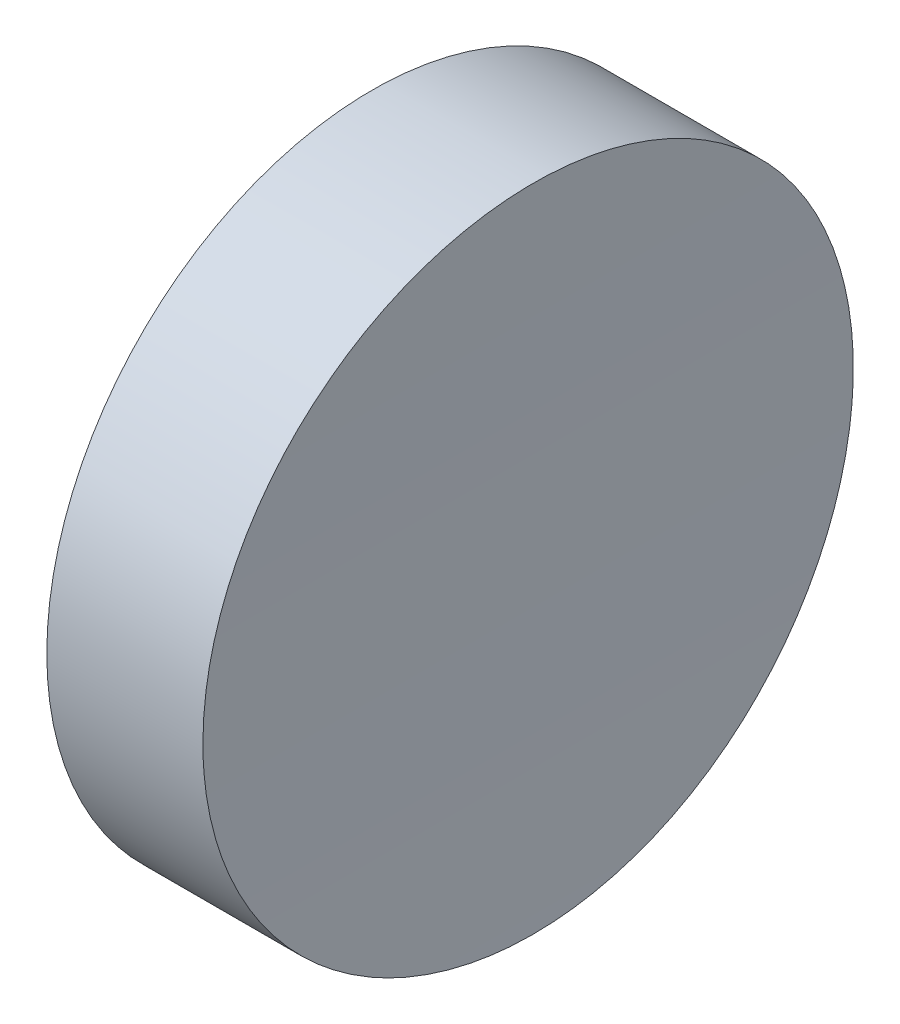
ISO-10303-21;
HEADER;
FILE_DESCRIPTION(('STEP AP214'),'2;1');
FILE_NAME('part.step','',(''),(''),'','','');
FILE_SCHEMA(('AUTOMOTIVE_DESIGN { 1 0 10303 214 1 1 1 1 }'));
ENDSEC;
DATA;
#1=APPLICATION_CONTEXT('core data for automotive mechanical design processes');
#2=APPLICATION_PROTOCOL_DEFINITION('international standard','automotive_design',2000,#1);
#3=PRODUCT_CONTEXT('',#1,'mechanical');
#4=PRODUCT('Part','Part','',(#3));
#5=PRODUCT_RELATED_PRODUCT_CATEGORY('part','',(#4));
#6=PRODUCT_DEFINITION_FORMATION('','',#4);
#7=PRODUCT_DEFINITION_CONTEXT('part definition',#1,'design');
#8=PRODUCT_DEFINITION('design','',#6,#7);
#9=PRODUCT_DEFINITION_SHAPE('','',#8);
#10=(LENGTH_UNIT() NAMED_UNIT(*) SI_UNIT(.MILLI.,.METRE.));
#11=(NAMED_UNIT(*) PLANE_ANGLE_UNIT() SI_UNIT($,.RADIAN.));
#12=(NAMED_UNIT(*) SI_UNIT($,.STERADIAN.) SOLID_ANGLE_UNIT());
#13=UNCERTAINTY_MEASURE_WITH_UNIT(LENGTH_MEASURE(1.E-05),#10,'distance_accuracy_value','');
#14=(GEOMETRIC_REPRESENTATION_CONTEXT(3) GLOBAL_UNCERTAINTY_ASSIGNED_CONTEXT((#13)) GLOBAL_UNIT_ASSIGNED_CONTEXT((#10,
#11,#12)) REPRESENTATION_CONTEXT('',''));
#15=CARTESIAN_POINT('',(0.,0.,0.));
#16=DIRECTION('',(0.,0.,1.));
#17=DIRECTION('',(1.,0.,0.));
#18=AXIS2_PLACEMENT_3D('',#15,#16,#17);
#19=CARTESIAN_POINT('',(10.,0.,0.));
#20=DIRECTION('',(-1.,0.,0.));
#21=DIRECTION('',(0.,0.,1.));
#22=AXIS2_PLACEMENT_3D('',#19,#20,#21);
#23=CYLINDRICAL_SURFACE('',#22,12.5);
#24=CARTESIAN_POINT('',(6.00000000000001,0.,12.5));
#25=CARTESIAN_POINT('',(5.99999977382754,0.351099468668451,12.5000026052159));
#26=CARTESIAN_POINT('',(6.00046323593843,0.702156492550774,12.4852014649906));
#27=CARTESIAN_POINT('',(6.00230365422404,1.40189117371986,12.4261008576541));
#28=CARTESIAN_POINT('',(6.00368084865302,1.75056818645951,12.3817936968831));
#29=CARTESIAN_POINT('',(6.00731213238009,2.44331415988141,12.26392299042));
#30=CARTESIAN_POINT('',(6.00956715617061,2.78737780427473,12.1903282648103));
#31=CARTESIAN_POINT('',(6.01488989192599,3.46807412259718,12.0144093125861));
#32=CARTESIAN_POINT('',(6.01795760112087,3.80470682185014,11.9120851838943));
#33=CARTESIAN_POINT('',(6.02481688789678,4.46798033436541,11.6794948234819));
#34=CARTESIAN_POINT('',(6.02860810481775,4.79462603230022,11.5492425096523));
#35=CARTESIAN_POINT('',(6.03680789346641,5.4357853965173,11.2616908775884));
#36=CARTESIAN_POINT('',(6.04121647484159,5.75029887311261,11.1043911366779));
#37=CARTESIAN_POINT('',(6.05052472385401,6.36487762106631,10.763907803169));
#38=CARTESIAN_POINT('',(6.0554242682508,6.66494649042062,10.5807307015415));
#39=CARTESIAN_POINT('',(6.06557644504405,7.24859008730408,10.1897651976978));
#40=CARTESIAN_POINT('',(6.07082907616753,7.53216487429277,9.98197688421082));
#41=CARTESIAN_POINT('',(6.0815407483044,8.08092266850929,9.54317349681333));
#42=CARTESIAN_POINT('',(6.08699987329546,8.34609806600494,9.31214890832689));
#43=CARTESIAN_POINT('',(6.09796762216902,8.85604656105036,8.82858482076667));
#44=CARTESIAN_POINT('',(6.10347624611084,9.10081963415023,8.57604529591038));
#45=CARTESIAN_POINT('',(6.11438690228203,9.5682342703898,8.05123428643764));
#46=CARTESIAN_POINT('',(6.11978893029179,9.79087495882256,7.77896202268676));
#47=CARTESIAN_POINT('',(6.13033285258824,10.2124320603562,7.21662760548304));
#48=CARTESIAN_POINT('',(6.13547474691148,10.4113484767918,6.92656545453076));
#49=CARTESIAN_POINT('',(6.14535335685883,10.7840779547778,6.33065515871237));
#50=CARTESIAN_POINT('',(6.1500899965835,10.9578863180624,6.02480407388746));
#51=CARTESIAN_POINT('',(6.15902246474392,11.2791185974448,5.39953890011809));
#52=CARTESIAN_POINT('',(6.16321829307257,11.4265425083174,5.08012480848757));
#53=CARTESIAN_POINT('',(6.17094989007395,11.693955436793,4.43000530472064));
#54=CARTESIAN_POINT('',(6.1744856611791,11.8139445554979,4.09929993419964));
#55=CARTESIAN_POINT('',(6.18079665136721,12.0256333467032,3.42894856361745));
#56=CARTESIAN_POINT('',(6.18357187071423,12.1173330290258,3.08930256666048));
#57=CARTESIAN_POINT('',(6.18828207044255,12.2717635203074,2.40359917291702));
#58=CARTESIAN_POINT('',(6.19021732697225,12.3345038504511,2.05754392232527));
#59=CARTESIAN_POINT('',(6.19319392287074,12.4306126557383,1.36137468373482));
#60=CARTESIAN_POINT('',(6.19423526241602,12.4639811366811,1.01126069653749));
#61=CARTESIAN_POINT('',(6.19539441957912,12.5011081020088,0.309466112553118));
#62=CARTESIAN_POINT('',(6.19551224080233,12.5048667019897,-0.0422144781126022));
#63=CARTESIAN_POINT('',(6.19482102031748,12.4827473845885,-0.744641455483939));
#64=CARTESIAN_POINT('',(6.1940119787818,12.4568694727184,-1.09538784236329));
#65=CARTESIAN_POINT('',(6.19149047658629,12.375676036134,-1.79332875256855));
#66=CARTESIAN_POINT('',(6.18977833234659,12.3203708218055,-2.140524476535));
#67=CARTESIAN_POINT('',(6.18549945015647,12.1807234107726,-2.82902091578498));
#68=CARTESIAN_POINT('',(6.18293271243662,12.0963812219022,-3.17032163265889));
#69=CARTESIAN_POINT('',(6.17701752895914,11.899260523003,-3.84460368769656));
#70=CARTESIAN_POINT('',(6.17366908170448,11.7864819585162,-4.17758500992666));
#71=CARTESIAN_POINT('',(6.1662855438004,11.5332914465314,-4.83286272241351));
#72=CARTESIAN_POINT('',(6.16225045296831,11.3928794916818,-5.15515910982769));
#73=CARTESIAN_POINT('',(6.15360738272811,11.0853938169497,-5.78683472431068));
#74=CARTESIAN_POINT('',(6.14899930216055,10.9183153877084,-6.09621165757676));
#75=CARTESIAN_POINT('',(6.13934159717743,10.5587025260637,-6.69979168454184));
#76=CARTESIAN_POINT('',(6.13429197272788,10.3661680917004,-6.99399477707255));
#77=CARTESIAN_POINT('',(6.12389443878594,9.95701076125281,-7.56513985761225));
#78=CARTESIAN_POINT('',(6.11854652867678,9.7403878153589,-7.84208180992715));
#79=CARTESIAN_POINT('',(6.10770412397777,9.28459194523558,-8.37673889655365));
#80=CARTESIAN_POINT('',(6.1022096293438,9.04541901421859,-8.63445402507788));
#81=CARTESIAN_POINT('',(6.09122752164166,8.5461137115251,-9.12893462634897));
#82=CARTESIAN_POINT('',(6.08573991252979,8.28597240498336,-9.36569107723557));
#83=CARTESIAN_POINT('',(6.07492967519281,7.7466669797555,-9.81644838526757));
#84=CARTESIAN_POINT('',(6.06960704701808,7.46750285526068,-10.0304492354644));
#85=CARTESIAN_POINT('',(6.05927782198993,6.89213430410796,-10.4341744026893));
#86=CARTESIAN_POINT('',(6.05427122524844,6.59592987141536,-10.6238987111199));
#87=CARTESIAN_POINT('',(6.04471615446278,5.98858478101447,-10.977721389298));
#88=CARTESIAN_POINT('',(6.04016768035764,5.67744412529386,-11.1418197624558));
#89=CARTESIAN_POINT('',(6.0316579074533,5.04243374631346,-11.4432243689564));
#90=CARTESIAN_POINT('',(6.02769661517674,4.71856388170338,-11.580530304684));
#91=CARTESIAN_POINT('',(6.02047371970229,4.06040048919598,-11.82736974155));
#92=CARTESIAN_POINT('',(6.01721211654379,3.72610696071167,-11.9369032411244));
#93=CARTESIAN_POINT('',(6.01148121253047,3.04947443628677,-12.1274167520242));
#94=CARTESIAN_POINT('',(6.00901190975738,2.70713545982737,-12.208396832481));
#95=CARTESIAN_POINT('',(6.00493571771772,2.01684690932231,-12.3412261906117));
#96=CARTESIAN_POINT('',(6.00332882814051,1.66889733729764,-12.3930754787786));
#97=CARTESIAN_POINT('',(6.00102358472324,0.970011843282963,-12.4672575511444));
#98=CARTESIAN_POINT('',(6.00032484684893,0.61907724681763,-12.4896028119099));
#99=CARTESIAN_POINT('',(5.99985447849233,-0.0834276282662514,-12.5046581190748));
#100=CARTESIAN_POINT('',(6.00008284775018,-0.434997906706585,-12.4973681737811));
#101=CARTESIAN_POINT('',(6.00146021174111,-1.13627317364806,-12.4532051100543));
#102=CARTESIAN_POINT('',(6.00260920535298,-1.48597816442037,-12.4163320276499));
#103=CARTESIAN_POINT('',(6.00579521076333,-2.18103630950316,-12.3132657217684));
#104=CARTESIAN_POINT('',(6.00783222253978,-2.52638946392157,-12.2470724990187));
#105=CARTESIAN_POINT('',(6.0127359800875,-3.21022113414217,-12.0858537296726));
#106=CARTESIAN_POINT('',(6.01560256239566,-3.54870099024873,-11.9908338630579));
#107=CARTESIAN_POINT('',(6.02208432063024,-4.21645145774831,-11.7726340543014));
#108=CARTESIAN_POINT('',(6.0256994964223,-4.54572207079428,-11.649454117214));
#109=CARTESIAN_POINT('',(6.03357594013327,-5.19271646034605,-11.3758105929951));
#110=CARTESIAN_POINT('',(6.03783720913785,-5.51044021744798,-11.2253469600173));
#111=CARTESIAN_POINT('',(6.04688502574704,-6.13208519413537,-10.8982061461326));
#112=CARTESIAN_POINT('',(6.05167157353436,-6.43600640891938,-10.721528956107));
#113=CARTESIAN_POINT('',(6.06163593913456,-7.02798934639241,-10.3431528196724));
#114=CARTESIAN_POINT('',(6.06681388791496,-7.3160457042755,-10.1414454832561));
#115=CARTESIAN_POINT('',(6.07741277595594,-7.8741439213979,-9.71448912421291));
#116=CARTESIAN_POINT('',(6.08283371526541,-8.14418577701199,-9.48924009684856));
#117=CARTESIAN_POINT('',(6.09376484003145,-8.66433889827278,-9.01679941030542));
#118=CARTESIAN_POINT('',(6.09927502570859,-8.91445011465593,-8.76960769689298));
#119=CARTESIAN_POINT('',(6.11022832855283,-9.39296573696387,-8.25503693481256));
#120=CARTESIAN_POINT('',(6.11567144570791,-9.62137013899677,-7.98765788252516));
#121=CARTESIAN_POINT('',(6.12633803116941,-10.0549251026136,-7.43451464859491));
#122=CARTESIAN_POINT('',(6.13156142294217,-10.2600676032291,-7.14874414719421));
#123=CARTESIAN_POINT('',(6.14163823365231,-10.6455491659712,-6.56093081245859));
#124=CARTESIAN_POINT('',(6.14649165249071,-10.8258882214605,-6.25888797476935));
#125=CARTESIAN_POINT('',(6.15569064593816,-11.1604794622195,-5.64067655835678));
#126=CARTESIAN_POINT('',(6.16003622154389,-11.3147316986861,-5.32450800735759));
#127=CARTESIAN_POINT('',(6.16809606091463,-11.596051377002,-4.68029178368097));
#128=CARTESIAN_POINT('',(6.1718103248513,-11.7231188262431,-4.35224411423365));
#129=CARTESIAN_POINT('',(6.1785013491081,-11.94914257951,-3.68666376817943));
#130=CARTESIAN_POINT('',(6.18147824573744,-12.0481040796788,-3.34913285750231));
#131=CARTESIAN_POINT('',(6.18661081684748,-12.2172417983503,-2.66692809794138));
#132=CARTESIAN_POINT('',(6.18876649139573,-12.2874180192209,-2.32225424964512));
#133=CARTESIAN_POINT('',(6.19219533215562,-12.3984845679854,-1.6282157799794));
#134=CARTESIAN_POINT('',(6.19346849895507,-12.4393749153857,-1.27885116173444));
#135=CARTESIAN_POINT('',(6.19509612260833,-12.491577975331,-0.577916987729713));
#136=CARTESIAN_POINT('',(6.19545057973541,-12.5028906966743,-0.226347432625859));
#137=CARTESIAN_POINT('',(6.19523075382213,-12.4958593078378,0.476343901559679));
#138=CARTESIAN_POINT('',(6.19465686860258,-12.4775279010023,0.827465807948405));
#139=CARTESIAN_POINT('',(6.19259741385357,-12.4113629150472,1.5269160529154));
#140=CARTESIAN_POINT('',(6.19111184460116,-12.3635293448933,1.87524439234259));
#141=CARTESIAN_POINT('',(6.18727122347955,-12.238700957111,2.56663180664615));
#142=CARTESIAN_POINT('',(6.18491617005156,-12.1617060872029,2.90969087207471));
#143=CARTESIAN_POINT('',(6.17940347334781,-11.9791037716037,3.58810101139961));
#144=CARTESIAN_POINT('',(6.17624582997446,-11.8734963224332,3.92345208435863));
#145=CARTESIAN_POINT('',(6.16921756292884,-11.6344190187663,4.58406907700369));
#146=CARTESIAN_POINT('',(6.16534692791972,-11.5009487212344,4.90933483623292));
#147=CARTESIAN_POINT('',(6.15700258915357,-11.2070965074575,5.5474659121643));
#148=CARTESIAN_POINT('',(6.15252888530986,-11.0467145873448,5.86033122708428));
#149=CARTESIAN_POINT('',(6.14310553617308,-10.700185777937,6.47142957592611));
#150=CARTESIAN_POINT('',(6.13815590806098,-10.5140398186227,6.76966313747083));
#151=CARTESIAN_POINT('',(6.12792098422158,-10.1173011640002,7.34939381612012));
#152=CARTESIAN_POINT('',(6.12263568871115,-9.90670848448615,7.63089094403742));
#153=CARTESIAN_POINT('',(6.11187758942122,-9.46250028943294,8.17523924285265));
#154=CARTESIAN_POINT('',(6.10640472617357,-9.2288774273159,8.43808441753222));
#155=CARTESIAN_POINT('',(6.09542834318496,-8.74032328910246,8.94316483599018));
#156=CARTESIAN_POINT('',(6.0899248233165,-8.48539192432884,9.18539999398972));
#157=CARTESIAN_POINT('',(6.07904188568233,-7.95596400162539,9.64759804997328));
#158=CARTESIAN_POINT('',(6.0736624997726,-7.68146249380324,9.86755527888506));
#159=CARTESIAN_POINT('',(6.06318202604471,-7.11490580674245,10.2835609461438));
#160=CARTESIAN_POINT('',(6.0580809338741,-6.82285090218605,10.4796097584734));
#161=CARTESIAN_POINT('',(6.04829844366927,-6.22305602347238,10.8465317711264));
#162=CARTESIAN_POINT('',(6.04361732935544,-5.91530566298024,11.0173880017421));
#163=CARTESIAN_POINT('',(6.03481166511185,-5.28649062365404,11.3325506995783));
#164=CARTESIAN_POINT('',(6.03068711708953,-4.96542589919419,11.4768570758083));
#165=CARTESIAN_POINT('',(6.02311590875445,-4.31260985401737,11.7377515301703));
#166=CARTESIAN_POINT('',(6.01966852857141,-3.98087032284067,11.8543690710465));
#167=CARTESIAN_POINT('',(6.01354469741888,-3.30885247363422,12.0592241667492));
#168=CARTESIAN_POINT('',(6.01086804518289,-2.96857641009783,12.1474691314423));
#169=CARTESIAN_POINT('',(6.0057864263859,-2.19421764796202,12.3137968391494));
#170=CARTESIAN_POINT('',(6.00362440497297,-1.75832201328415,12.3835630298881));
#171=CARTESIAN_POINT('',(6.00073133397569,-0.881595287224791,12.4766629676059));
#172=CARTESIAN_POINT('',(6.00000028393301,-0.44076419742414,12.499996729457));
#173=CARTESIAN_POINT('',(6.00000000000001,0.,12.5));
#174=B_SPLINE_CURVE_WITH_KNOTS('',3,(#24,#25,#26,#27,#28,#29,#30,#31,#32,#33,#34,#35,#36,#37,
#38,#39,#40,#41,#42,#43,#44,#45,#46,#47,#48,#49,#50,#51,#52,#53,#54,#55,#56,#57,#58,#59,#60,#61,
#62,#63,#64,#65,#66,#67,#68,#69,#70,#71,#72,#73,#74,#75,#76,#77,#78,#79,#80,#81,#82,#83,#84,#85,
#86,#87,#88,#89,#90,#91,#92,#93,#94,#95,#96,#97,#98,#99,#100,#101,#102,#103,#104,#105,#106,#107,
#108,#109,#110,#111,#112,#113,#114,#115,#116,#117,#118,#119,#120,#121,#122,#123,#124,#125,#126,
#127,#128,#129,#130,#131,#132,#133,#134,#135,#136,#137,#138,#139,#140,#141,#142,#143,#144,#145,
#146,#147,#148,#149,#150,#151,#152,#153,#154,#155,#156,#157,#158,#159,#160,#161,#162,#163,#164,
#165,#166,#167,#168,#169,#170,#171,#172,#173),.UNSPECIFIED.,.T.,.F.,(4,2,2,2,2,2,2,2,2,2,2,2,2,
2,2,2,2,2,2,2,2,2,2,2,2,2,2,2,2,2,2,2,2,2,2,2,2,2,2,2,2,2,2,2,2,2,2,2,2,2,2,2,2,2,2,2,2,2,2,2,2,
2,2,2,2,2,2,2,2,2,2,2,2,2,4),(0.,1.05291335839246,2.10610137024505,3.16041363202522,
4.21472230027403,5.26850677443893,6.32230771782381,7.37584479790569,8.42937807985444,
9.48334452287268,10.5373122289333,11.5913215729225,12.6453307687598,13.6995369379988,
14.7537433160165,15.8079458090451,16.8621479360571,17.9160032177688,18.9698582914062,
20.0237092508301,21.0775600142562,22.1310417849768,23.1845232714803,24.2380067755031,
25.2914905597876,26.3451605979319,27.3988307172024,28.4525030152711,29.5061756304982,
30.560299625643,31.6144239426697,32.6685486330093,33.7226731830693,34.7768094418632,
35.8309457600173,36.8850795259571,37.9392129121964,38.9929003870411,40.0465875665286,
41.1002734627521,42.1539593328414,43.2074377201045,44.2609159182786,45.3143958866845,
46.367876221558,47.4217106376458,48.4755452658064,49.5293824987019,50.5832199205427,
51.6374214207914,52.691623203135,53.7458229165173,54.8000223432494,55.8540267457197,
56.9080310614932,57.9620346752345,59.016037975448,60.0695897252227,61.1231411548274,
62.1766944732285,63.2302479197451,64.2838181196489,65.3373884709691,66.390920802443,
67.4444524532646,68.4983212726495,69.5521944780208,70.6063351926087,71.6604594158943,
72.715290484261,73.7701251676313,74.8238323562081,75.8772641315199,77.1990737650489,
78.5208829752111),.UNSPECIFIED.);
#175=CARTESIAN_POINT('',(6.00000000000001,0.,12.5));
#176=VERTEX_POINT('',#175);
#177=EDGE_CURVE('E10',#176,#176,#174,.T.);
#178=ORIENTED_EDGE('',*,*,#177,.T.);
#179=EDGE_LOOP('',(#178));
#180=FACE_BOUND('',#179,.T.);
#181=CARTESIAN_POINT('',(0.,0.,0.));
#182=DIRECTION('',(1.,0.,0.));
#183=DIRECTION('',(0.,0.,-1.));
#184=AXIS2_PLACEMENT_3D('',#181,#182,#183);
#185=CIRCLE('',#184,12.5);
#186=CARTESIAN_POINT('',(0.,0.,-12.5));
#187=VERTEX_POINT('',#186);
#188=EDGE_CURVE('E46',#187,#187,#185,.T.);
#189=ORIENTED_EDGE('',*,*,#188,.T.);
#190=EDGE_LOOP('',(#189));
#191=FACE_BOUND('',#190,.T.);
#192=ADVANCED_FACE('F35',(#180,#191),#23,.T.);
#193=CARTESIAN_POINT('',(0.,0.,0.));
#194=DIRECTION('',(1.,0.,0.));
#195=DIRECTION('',(0.,0.,-1.));
#196=AXIS2_PLACEMENT_3D('',#193,#194,#195);
#197=PLANE('',#196);
#198=ORIENTED_EDGE('',*,*,#188,.F.);
#199=EDGE_LOOP('',(#198));
#200=FACE_BOUND('',#199,.T.);
#201=ADVANCED_FACE('F53',(#200),#197,.F.);
#202=CARTESIAN_POINT('',(406.,0.,-12.5));
#203=DIRECTION('',(0.,0.,1.));
#204=DIRECTION('',(1.,0.,0.));
#205=AXIS2_PLACEMENT_3D('',#202,#203,#204);
#206=CYLINDRICAL_SURFACE('',#205,400.);
#207=ORIENTED_EDGE('',*,*,#177,.F.);
#208=EDGE_LOOP('',(#207));
#209=FACE_BOUND('',#208,.T.);
#210=ADVANCED_FACE('F55',(#209),#206,.F.);
#211=CLOSED_SHELL('',(#192,#201,#210));
#212=MANIFOLD_SOLID_BREP('B2',#211);
#213=ADVANCED_BREP_SHAPE_REPRESENTATION('',(#18,#212),#14);
#214=SHAPE_DEFINITION_REPRESENTATION(#9,#213);
ENDSEC;
END-ISO-10303-21;
